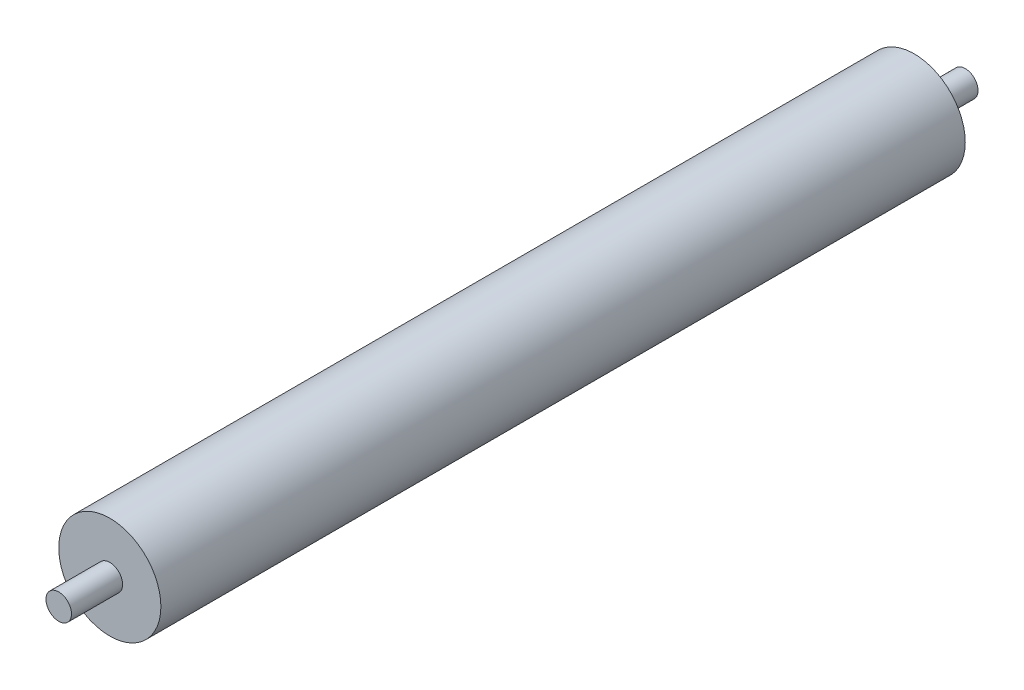
ISO-10303-21;
HEADER;
FILE_DESCRIPTION(('STEP AP214'),'2;1');
FILE_NAME('part.step','',(''),(''),'','','');
FILE_SCHEMA(('AUTOMOTIVE_DESIGN { 1 0 10303 214 1 1 1 1 }'));
ENDSEC;
DATA;
#1=APPLICATION_CONTEXT('core data for automotive mechanical design processes');
#2=APPLICATION_PROTOCOL_DEFINITION('international standard','automotive_design',2000,#1);
#3=PRODUCT_CONTEXT('',#1,'mechanical');
#4=PRODUCT('Part','Part','',(#3));
#5=PRODUCT_RELATED_PRODUCT_CATEGORY('part','',(#4));
#6=PRODUCT_DEFINITION_FORMATION('','',#4);
#7=PRODUCT_DEFINITION_CONTEXT('part definition',#1,'design');
#8=PRODUCT_DEFINITION('design','',#6,#7);
#9=PRODUCT_DEFINITION_SHAPE('','',#8);
#10=(LENGTH_UNIT() NAMED_UNIT(*) SI_UNIT(.MILLI.,.METRE.));
#11=(NAMED_UNIT(*) PLANE_ANGLE_UNIT() SI_UNIT($,.RADIAN.));
#12=(NAMED_UNIT(*) SI_UNIT($,.STERADIAN.) SOLID_ANGLE_UNIT());
#13=UNCERTAINTY_MEASURE_WITH_UNIT(LENGTH_MEASURE(1.E-05),#10,'distance_accuracy_value','');
#14=(GEOMETRIC_REPRESENTATION_CONTEXT(3) GLOBAL_UNCERTAINTY_ASSIGNED_CONTEXT((#13)) GLOBAL_UNIT_ASSIGNED_CONTEXT((#10,
#11,#12)) REPRESENTATION_CONTEXT('',''));
#15=CARTESIAN_POINT('',(0.,0.,0.));
#16=DIRECTION('',(0.,0.,1.));
#17=DIRECTION('',(1.,0.,0.));
#18=AXIS2_PLACEMENT_3D('',#15,#16,#17);
#19=CARTESIAN_POINT('',(0.,0.,315.));
#20=DIRECTION('',(0.,0.,-1.));
#21=DIRECTION('',(-1.,0.,0.));
#22=AXIS2_PLACEMENT_3D('',#19,#20,#21);
#23=CYLINDRICAL_SURFACE('',#22,20.);
#24=CARTESIAN_POINT('',(0.,0.,315.));
#25=DIRECTION('',(0.,0.,1.));
#26=DIRECTION('',(1.,0.,0.));
#27=AXIS2_PLACEMENT_3D('',#24,#25,#26);
#28=CIRCLE('',#27,20.);
#29=CARTESIAN_POINT('',(20.,0.,315.));
#30=VERTEX_POINT('',#29);
#31=EDGE_CURVE('E45',#30,#30,#28,.T.);
#32=ORIENTED_EDGE('',*,*,#31,.F.);
#33=EDGE_LOOP('',(#32));
#34=FACE_BOUND('',#33,.T.);
#35=CARTESIAN_POINT('',(0.,0.,0.));
#36=DIRECTION('',(0.,0.,1.));
#37=DIRECTION('',(1.,0.,0.));
#38=AXIS2_PLACEMENT_3D('',#35,#36,#37);
#39=CIRCLE('',#38,20.);
#40=CARTESIAN_POINT('',(20.,0.,0.));
#41=VERTEX_POINT('',#40);
#42=EDGE_CURVE('E36',#41,#41,#39,.T.);
#43=ORIENTED_EDGE('',*,*,#42,.T.);
#44=EDGE_LOOP('',(#43));
#45=FACE_BOUND('',#44,.T.);
#46=ADVANCED_FACE('F33',(#34,#45),#23,.T.);
#47=CARTESIAN_POINT('',(0.,0.,315.));
#48=DIRECTION('',(0.,0.,1.));
#49=DIRECTION('',(1.,0.,0.));
#50=AXIS2_PLACEMENT_3D('',#47,#48,#49);
#51=PLANE('',#50);
#52=CARTESIAN_POINT('',(0.,0.,315.));
#53=DIRECTION('',(0.,0.,1.));
#54=DIRECTION('',(1.,0.,0.));
#55=AXIS2_PLACEMENT_3D('',#52,#53,#54);
#56=CIRCLE('',#55,5.);
#57=CARTESIAN_POINT('',(5.,0.,315.));
#58=VERTEX_POINT('',#57);
#59=EDGE_CURVE('E40',#58,#58,#56,.T.);
#60=ORIENTED_EDGE('',*,*,#59,.F.);
#61=EDGE_LOOP('',(#60));
#62=FACE_BOUND('',#61,.T.);
#63=ORIENTED_EDGE('',*,*,#31,.T.);
#64=EDGE_LOOP('',(#63));
#65=FACE_BOUND('',#64,.T.);
#66=ADVANCED_FACE('F62',(#62,#65),#51,.T.);
#67=CARTESIAN_POINT('',(0.,0.,0.));
#68=DIRECTION('',(0.,0.,1.));
#69=DIRECTION('',(1.,0.,0.));
#70=AXIS2_PLACEMENT_3D('',#67,#68,#69);
#71=PLANE('',#70);
#72=CARTESIAN_POINT('',(0.,0.,0.));
#73=DIRECTION('',(0.,0.,-1.));
#74=DIRECTION('',(-1.,0.,0.));
#75=AXIS2_PLACEMENT_3D('',#72,#73,#74);
#76=CIRCLE('',#75,5.);
#77=CARTESIAN_POINT('',(-5.,0.,0.));
#78=VERTEX_POINT('',#77);
#79=EDGE_CURVE('E10',#78,#78,#76,.T.);
#80=ORIENTED_EDGE('',*,*,#79,.F.);
#81=EDGE_LOOP('',(#80));
#82=FACE_BOUND('',#81,.T.);
#83=ORIENTED_EDGE('',*,*,#42,.F.);
#84=EDGE_LOOP('',(#83));
#85=FACE_BOUND('',#84,.T.);
#86=ADVANCED_FACE('F59',(#82,#85),#71,.F.);
#87=CARTESIAN_POINT('',(0.,0.,335.));
#88=DIRECTION('',(0.,0.,-1.));
#89=DIRECTION('',(-1.,0.,0.));
#90=AXIS2_PLACEMENT_3D('',#87,#88,#89);
#91=CYLINDRICAL_SURFACE('',#90,5.);
#92=CARTESIAN_POINT('',(0.,0.,335.));
#93=DIRECTION('',(0.,0.,1.));
#94=DIRECTION('',(1.,0.,0.));
#95=AXIS2_PLACEMENT_3D('',#92,#93,#94);
#96=CIRCLE('',#95,5.);
#97=CARTESIAN_POINT('',(5.,0.,335.));
#98=VERTEX_POINT('',#97);
#99=EDGE_CURVE('E50',#98,#98,#96,.T.);
#100=ORIENTED_EDGE('',*,*,#99,.F.);
#101=EDGE_LOOP('',(#100));
#102=FACE_BOUND('',#101,.T.);
#103=ORIENTED_EDGE('',*,*,#59,.T.);
#104=EDGE_LOOP('',(#103));
#105=FACE_BOUND('',#104,.T.);
#106=ADVANCED_FACE('F61',(#102,#105),#91,.T.);
#107=CARTESIAN_POINT('',(0.,0.,335.));
#108=DIRECTION('',(0.,0.,1.));
#109=DIRECTION('',(1.,0.,0.));
#110=AXIS2_PLACEMENT_3D('',#107,#108,#109);
#111=PLANE('',#110);
#112=ORIENTED_EDGE('',*,*,#99,.T.);
#113=EDGE_LOOP('',(#112));
#114=FACE_BOUND('',#113,.T.);
#115=ADVANCED_FACE('F68',(#114),#111,.T.);
#116=CARTESIAN_POINT('',(0.,0.,-20.));
#117=DIRECTION('',(0.,0.,1.));
#118=DIRECTION('',(1.,0.,0.));
#119=AXIS2_PLACEMENT_3D('',#116,#117,#118);
#120=CYLINDRICAL_SURFACE('',#119,5.);
#121=CARTESIAN_POINT('',(0.,0.,-20.));
#122=DIRECTION('',(0.,0.,-1.));
#123=DIRECTION('',(-1.,0.,0.));
#124=AXIS2_PLACEMENT_3D('',#121,#122,#123);
#125=CIRCLE('',#124,5.);
#126=CARTESIAN_POINT('',(-5.,0.,-20.));
#127=VERTEX_POINT('',#126);
#128=EDGE_CURVE('E49',#127,#127,#125,.T.);
#129=ORIENTED_EDGE('',*,*,#128,.F.);
#130=EDGE_LOOP('',(#129));
#131=FACE_BOUND('',#130,.T.);
#132=ORIENTED_EDGE('',*,*,#79,.T.);
#133=EDGE_LOOP('',(#132));
#134=FACE_BOUND('',#133,.T.);
#135=ADVANCED_FACE('F100',(#131,#134),#120,.T.);
#136=CARTESIAN_POINT('',(0.,0.,-20.));
#137=DIRECTION('',(0.,0.,-1.));
#138=DIRECTION('',(-1.,0.,0.));
#139=AXIS2_PLACEMENT_3D('',#136,#137,#138);
#140=PLANE('',#139);
#141=ORIENTED_EDGE('',*,*,#128,.T.);
#142=EDGE_LOOP('',(#141));
#143=FACE_BOUND('',#142,.T.);
#144=ADVANCED_FACE('F105',(#143),#140,.T.);
#145=CLOSED_SHELL('',(#46,#66,#86,#106,#115,#135,#144));
#146=MANIFOLD_SOLID_BREP('B2',#145);
#147=ADVANCED_BREP_SHAPE_REPRESENTATION('',(#18,#146),#14);
#148=SHAPE_DEFINITION_REPRESENTATION(#9,#147);
ENDSEC;
END-ISO-10303-21;
